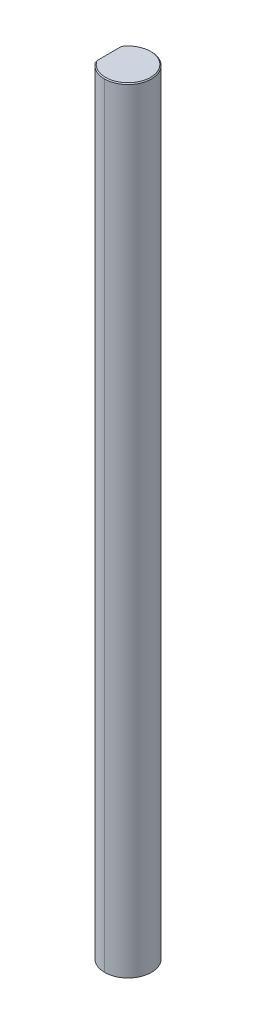
ISO-10303-21;
HEADER;
FILE_DESCRIPTION(('STEP AP214'),'2;1');
FILE_NAME('part.step','',(''),(''),'','','');
FILE_SCHEMA(('AUTOMOTIVE_DESIGN { 1 0 10303 214 1 1 1 1 }'));
ENDSEC;
DATA;
#1=APPLICATION_CONTEXT('core data for automotive mechanical design processes');
#2=APPLICATION_PROTOCOL_DEFINITION('international standard','automotive_design',2000,#1);
#3=PRODUCT_CONTEXT('',#1,'mechanical');
#4=PRODUCT('Part','Part','',(#3));
#5=PRODUCT_RELATED_PRODUCT_CATEGORY('part','',(#4));
#6=PRODUCT_DEFINITION_FORMATION('','',#4);
#7=PRODUCT_DEFINITION_CONTEXT('part definition',#1,'design');
#8=PRODUCT_DEFINITION('design','',#6,#7);
#9=PRODUCT_DEFINITION_SHAPE('','',#8);
#10=(LENGTH_UNIT() NAMED_UNIT(*) SI_UNIT(.MILLI.,.METRE.));
#11=(NAMED_UNIT(*) PLANE_ANGLE_UNIT() SI_UNIT($,.RADIAN.));
#12=(NAMED_UNIT(*) SI_UNIT($,.STERADIAN.) SOLID_ANGLE_UNIT());
#13=UNCERTAINTY_MEASURE_WITH_UNIT(LENGTH_MEASURE(1.E-05),#10,'distance_accuracy_value','');
#14=(GEOMETRIC_REPRESENTATION_CONTEXT(3) GLOBAL_UNCERTAINTY_ASSIGNED_CONTEXT((#13)) GLOBAL_UNIT_ASSIGNED_CONTEXT((#10,
#11,#12)) REPRESENTATION_CONTEXT('',''));
#15=CARTESIAN_POINT('',(0.,0.,0.));
#16=DIRECTION('',(0.,0.,1.));
#17=DIRECTION('',(1.,0.,0.));
#18=AXIS2_PLACEMENT_3D('',#15,#16,#17);
#19=CARTESIAN_POINT('',(0.,304.8,0.));
#20=DIRECTION('',(0.,-1.,0.));
#21=DIRECTION('',(0.,0.,-1.));
#22=AXIS2_PLACEMENT_3D('',#19,#20,#21);
#23=CONICAL_SURFACE('',#22,3.04419000000011,0.785398163397486);
#24=DIRECTION('',(0.,-0.707106781186521,0.707106781186574));
#25=VECTOR('',#24,1.);
#26=CARTESIAN_POINT('',(0.,304.8,3.04419000000011));
#27=LINE('',#26,#25);
#28=CARTESIAN_POINT('',(0.,304.8,3.04419000000011));
#29=VERTEX_POINT('',#28);
#30=CARTESIAN_POINT('',(0.,304.673,3.17119));
#31=VERTEX_POINT('',#30);
#32=EDGE_CURVE('E146',#29,#31,#27,.T.);
#33=ORIENTED_EDGE('',*,*,#32,.F.);
#34=CARTESIAN_POINT('',(0.,304.8,0.));
#35=DIRECTION('',(0.,1.,0.));
#36=DIRECTION('',(0.,0.,1.));
#37=AXIS2_PLACEMENT_3D('',#34,#35,#36);
#38=CIRCLE('',#37,3.04419000000011);
#39=CARTESIAN_POINT('',(-2.54381,304.8,1.6721613080085));
#40=VERTEX_POINT('',#39);
#41=EDGE_CURVE('E11',#40,#29,#38,.T.);
#42=ORIENTED_EDGE('',*,*,#41,.F.);
#43=CARTESIAN_POINT('',(-2.54381,304.673,1.89353550270387));
#44=CARTESIAN_POINT('',(-2.54381,304.716613746444,1.82049357854227));
#45=CARTESIAN_POINT('',(-2.54381,304.759042414268,1.74672509100744));
#46=CARTESIAN_POINT('',(-2.54381,304.8,1.6721613080085));
#47=(BOUNDED_CURVE() B_SPLINE_CURVE(3,(#43,#44,#45,#46),.UNSPECIFIED.,.F.,
.F.) B_SPLINE_CURVE_WITH_KNOTS((4,4),(0.,0.00025521664145779),
.UNSPECIFIED.) CURVE() GEOMETRIC_REPRESENTATION_ITEM() RATIONAL_B_SPLINE_CURVE((1.,1.,1.,1.)) REPRESENTATION_ITEM(''));
#48=CARTESIAN_POINT('',(-2.54381,304.673,1.89353550270387));
#49=VERTEX_POINT('',#48);
#50=EDGE_CURVE('E157',#49,#40,#47,.T.);
#51=ORIENTED_EDGE('',*,*,#50,.F.);
#52=CARTESIAN_POINT('',(0.,304.673,0.));
#53=DIRECTION('',(0.,-1.,0.));
#54=DIRECTION('',(0.,0.,1.));
#55=AXIS2_PLACEMENT_3D('',#52,#53,#54);
#56=CIRCLE('',#55,3.17119);
#57=EDGE_CURVE('E48',#31,#49,#56,.T.);
#58=ORIENTED_EDGE('',*,*,#57,.F.);
#59=EDGE_LOOP('',(#33,#42,#51,#58));
#60=FACE_BOUND('',#59,.T.);
#61=ADVANCED_FACE('F44',(#60),#23,.T.);
#62=CARTESIAN_POINT('',(0.,304.8,0.));
#63=DIRECTION('',(0.,1.,0.));
#64=DIRECTION('',(1.,0.,0.));
#65=AXIS2_PLACEMENT_3D('',#62,#63,#64);
#66=PLANE('',#65);
#67=DIRECTION('',(0.,0.,1.));
#68=VECTOR('',#67,1.);
#69=CARTESIAN_POINT('',(-2.54381,304.8,-1.89353550270387));
#70=LINE('',#69,#68);
#71=CARTESIAN_POINT('',(-2.54381,304.8,-1.6721613080085));
#72=VERTEX_POINT('',#71);
#73=EDGE_CURVE('E54',#72,#40,#70,.T.);
#74=ORIENTED_EDGE('',*,*,#73,.T.);
#75=ORIENTED_EDGE('',*,*,#41,.T.);
#76=CARTESIAN_POINT('',(0.,304.8,0.));
#77=DIRECTION('',(0.,1.,0.));
#78=DIRECTION('',(0.,0.,1.));
#79=AXIS2_PLACEMENT_3D('',#76,#77,#78);
#80=CIRCLE('',#79,3.04419000000011);
#81=CARTESIAN_POINT('',(0.,304.8,-3.04419000000011));
#82=VERTEX_POINT('',#81);
#83=EDGE_CURVE('E152',#29,#82,#80,.T.);
#84=ORIENTED_EDGE('',*,*,#83,.T.);
#85=CARTESIAN_POINT('',(0.,304.8,0.));
#86=DIRECTION('',(0.,1.,0.));
#87=DIRECTION('',(0.,0.,1.));
#88=AXIS2_PLACEMENT_3D('',#85,#86,#87);
#89=CIRCLE('',#88,3.04419000000011);
#90=EDGE_CURVE('E135',#82,#72,#89,.T.);
#91=ORIENTED_EDGE('',*,*,#90,.T.);
#92=EDGE_LOOP('',(#74,#75,#84,#91));
#93=FACE_BOUND('',#92,.T.);
#94=ADVANCED_FACE('F193',(#93),#66,.T.);
#95=CARTESIAN_POINT('',(-2.54381,304.8,-1.89353550270387));
#96=DIRECTION('',(1.,0.,0.));
#97=DIRECTION('',(0.,1.,0.));
#98=AXIS2_PLACEMENT_3D('',#95,#96,#97);
#99=PLANE('',#98);
#100=DIRECTION('',(0.,-1.,0.));
#101=VECTOR('',#100,1.);
#102=CARTESIAN_POINT('',(-2.54381,304.8,-1.89353550270387));
#103=LINE('',#102,#101);
#104=CARTESIAN_POINT('',(-2.54381,304.673,-1.89353550270387));
#105=VERTEX_POINT('',#104);
#106=CARTESIAN_POINT('',(-2.54381,200.025,-1.89353550270387));
#107=VERTEX_POINT('',#106);
#108=EDGE_CURVE('E123',#105,#107,#103,.T.);
#109=ORIENTED_EDGE('',*,*,#108,.T.);
#110=DIRECTION('',(0.,0.,1.));
#111=VECTOR('',#110,1.);
#112=CARTESIAN_POINT('',(-2.54381,200.025,1.89353550270387));
#113=LINE('',#112,#111);
#114=CARTESIAN_POINT('',(-2.54381,200.025,1.89353550270387));
#115=VERTEX_POINT('',#114);
#116=EDGE_CURVE('E155',#107,#115,#113,.T.);
#117=ORIENTED_EDGE('',*,*,#116,.T.);
#118=DIRECTION('',(0.,-1.,0.));
#119=VECTOR('',#118,1.);
#120=CARTESIAN_POINT('',(-2.54381,304.8,1.89353550270387));
#121=LINE('',#120,#119);
#122=EDGE_CURVE('E162',#49,#115,#121,.T.);
#123=ORIENTED_EDGE('',*,*,#122,.F.);
#124=ORIENTED_EDGE('',*,*,#50,.T.);
#125=ORIENTED_EDGE('',*,*,#73,.F.);
#126=CARTESIAN_POINT('',(-2.54381,304.8,-1.6721613080085));
#127=CARTESIAN_POINT('',(-2.54381,304.759042414268,-1.74672509100745));
#128=CARTESIAN_POINT('',(-2.54381,304.716613746444,-1.82049357854228));
#129=CARTESIAN_POINT('',(-2.54381,304.673,-1.89353550270387));
#130=(BOUNDED_CURVE() B_SPLINE_CURVE(3,(#126,#127,#128,#129),.UNSPECIFIED.,.F.,
.F.) B_SPLINE_CURVE_WITH_KNOTS((4,4),(0.,0.00025521664145779),
.UNSPECIFIED.) CURVE() GEOMETRIC_REPRESENTATION_ITEM() RATIONAL_B_SPLINE_CURVE((1.,1.,1.,1.)) REPRESENTATION_ITEM(''));
#131=EDGE_CURVE('E134',#72,#105,#130,.T.);
#132=ORIENTED_EDGE('',*,*,#131,.T.);
#133=EDGE_LOOP('',(#109,#117,#123,#124,#125,#132));
#134=FACE_BOUND('',#133,.T.);
#135=ADVANCED_FACE('F191',(#134),#99,.F.);
#136=CARTESIAN_POINT('',(0.,304.8,0.));
#137=DIRECTION('',(0.,-1.,0.));
#138=DIRECTION('',(0.,0.,-1.));
#139=AXIS2_PLACEMENT_3D('',#136,#137,#138);
#140=CYLINDRICAL_SURFACE('',#139,3.17119);
#141=CARTESIAN_POINT('',(0.,200.025,0.));
#142=DIRECTION('',(0.,1.,0.));
#143=DIRECTION('',(0.,0.,1.));
#144=AXIS2_PLACEMENT_3D('',#141,#142,#143);
#145=CIRCLE('',#144,3.17119);
#146=CARTESIAN_POINT('',(0.,200.025,3.17119));
#147=VERTEX_POINT('',#146);
#148=EDGE_CURVE('E187',#115,#147,#145,.T.);
#149=ORIENTED_EDGE('',*,*,#148,.T.);
#150=DIRECTION('',(0.,-1.,0.));
#151=VECTOR('',#150,1.);
#152=CARTESIAN_POINT('',(0.,304.8,3.17119));
#153=LINE('',#152,#151);
#154=EDGE_CURVE('E124',#31,#147,#153,.T.);
#155=ORIENTED_EDGE('',*,*,#154,.F.);
#156=ORIENTED_EDGE('',*,*,#57,.T.);
#157=ORIENTED_EDGE('',*,*,#122,.T.);
#158=EDGE_LOOP('',(#149,#155,#156,#157));
#159=FACE_BOUND('',#158,.T.);
#160=ADVANCED_FACE('F195',(#159),#140,.T.);
#161=CARTESIAN_POINT('',(0.,304.8,0.));
#162=DIRECTION('',(0.,-1.,0.));
#163=DIRECTION('',(0.,0.,-1.));
#164=AXIS2_PLACEMENT_3D('',#161,#162,#163);
#165=CYLINDRICAL_SURFACE('',#164,3.17119);
#166=CARTESIAN_POINT('',(0.,200.025,-3.17119));
#167=VERTEX_POINT('',#166);
#168=EDGE_CURVE('E62',#167,#107,#145,.T.);
#169=ORIENTED_EDGE('',*,*,#168,.T.);
#170=ORIENTED_EDGE('',*,*,#108,.F.);
#171=CARTESIAN_POINT('',(0.,304.673,0.));
#172=DIRECTION('',(0.,-1.,0.));
#173=DIRECTION('',(0.,0.,1.));
#174=AXIS2_PLACEMENT_3D('',#171,#172,#173);
#175=CIRCLE('',#174,3.17119);
#176=CARTESIAN_POINT('',(0.,304.673,-3.17119));
#177=VERTEX_POINT('',#176);
#178=EDGE_CURVE('E127',#105,#177,#175,.T.);
#179=ORIENTED_EDGE('',*,*,#178,.T.);
#180=DIRECTION('',(0.,-1.,0.));
#181=VECTOR('',#180,1.);
#182=CARTESIAN_POINT('',(0.,304.8,-3.17119));
#183=LINE('',#182,#181);
#184=EDGE_CURVE('E114',#177,#167,#183,.T.);
#185=ORIENTED_EDGE('',*,*,#184,.T.);
#186=EDGE_LOOP('',(#169,#170,#179,#185));
#187=FACE_BOUND('',#186,.T.);
#188=ADVANCED_FACE('F46',(#187),#165,.T.);
#189=CARTESIAN_POINT('',(0.,304.8,0.));
#190=DIRECTION('',(0.,-1.,0.));
#191=DIRECTION('',(0.,0.,-1.));
#192=AXIS2_PLACEMENT_3D('',#189,#190,#191);
#193=CYLINDRICAL_SURFACE('',#192,3.17119);
#194=EDGE_CURVE('E102',#147,#167,#145,.T.);
#195=ORIENTED_EDGE('',*,*,#194,.T.);
#196=ORIENTED_EDGE('',*,*,#184,.F.);
#197=CARTESIAN_POINT('',(0.,304.673,0.));
#198=DIRECTION('',(0.,-1.,0.));
#199=DIRECTION('',(0.,0.,1.));
#200=AXIS2_PLACEMENT_3D('',#197,#198,#199);
#201=CIRCLE('',#200,3.17119);
#202=EDGE_CURVE('E119',#177,#31,#201,.T.);
#203=ORIENTED_EDGE('',*,*,#202,.T.);
#204=ORIENTED_EDGE('',*,*,#154,.T.);
#205=EDGE_LOOP('',(#195,#196,#203,#204));
#206=FACE_BOUND('',#205,.T.);
#207=ADVANCED_FACE('F116',(#206),#193,.T.);
#208=CARTESIAN_POINT('',(0.,304.8,0.));
#209=DIRECTION('',(0.,-1.,0.));
#210=DIRECTION('',(0.,0.,-1.));
#211=AXIS2_PLACEMENT_3D('',#208,#209,#210);
#212=CONICAL_SURFACE('',#211,3.04419000000011,0.785398163397486);
#213=ORIENTED_EDGE('',*,*,#90,.F.);
#214=DIRECTION('',(0.,-0.707106781186521,-0.707106781186574));
#215=VECTOR('',#214,1.);
#216=CARTESIAN_POINT('',(0.,304.8,-3.04419000000011));
#217=LINE('',#216,#215);
#218=EDGE_CURVE('E138',#82,#177,#217,.T.);
#219=ORIENTED_EDGE('',*,*,#218,.T.);
#220=ORIENTED_EDGE('',*,*,#178,.F.);
#221=ORIENTED_EDGE('',*,*,#131,.F.);
#222=EDGE_LOOP('',(#213,#219,#220,#221));
#223=FACE_BOUND('',#222,.T.);
#224=ADVANCED_FACE('F139',(#223),#212,.T.);
#225=CARTESIAN_POINT('',(0.,304.8,0.));
#226=DIRECTION('',(0.,-1.,0.));
#227=DIRECTION('',(0.,0.,-1.));
#228=AXIS2_PLACEMENT_3D('',#225,#226,#227);
#229=CONICAL_SURFACE('',#228,3.04419000000011,0.785398163397486);
#230=ORIENTED_EDGE('',*,*,#83,.F.);
#231=ORIENTED_EDGE('',*,*,#32,.T.);
#232=ORIENTED_EDGE('',*,*,#202,.F.);
#233=ORIENTED_EDGE('',*,*,#218,.F.);
#234=EDGE_LOOP('',(#230,#231,#232,#233));
#235=FACE_BOUND('',#234,.T.);
#236=ADVANCED_FACE('F145',(#235),#229,.T.);
#237=CARTESIAN_POINT('',(0.,200.025,0.));
#238=DIRECTION('',(0.,1.,0.));
#239=DIRECTION('',(0.,0.,1.));
#240=AXIS2_PLACEMENT_3D('',#237,#238,#239);
#241=PLANE('',#240);
#242=ORIENTED_EDGE('',*,*,#116,.F.);
#243=ORIENTED_EDGE('',*,*,#168,.F.);
#244=ORIENTED_EDGE('',*,*,#194,.F.);
#245=ORIENTED_EDGE('',*,*,#148,.F.);
#246=EDGE_LOOP('',(#242,#243,#244,#245));
#247=FACE_BOUND('',#246,.T.);
#248=ADVANCED_FACE('F215',(#247),#241,.F.);
#249=CLOSED_SHELL('',(#61,#94,#135,#160,#188,#207,#224,#236,#248));
#250=MANIFOLD_SOLID_BREP('B2',#249);
#251=ADVANCED_BREP_SHAPE_REPRESENTATION('',(#18,#250),#14);
#252=SHAPE_DEFINITION_REPRESENTATION(#9,#251);
ENDSEC;
END-ISO-10303-21;
